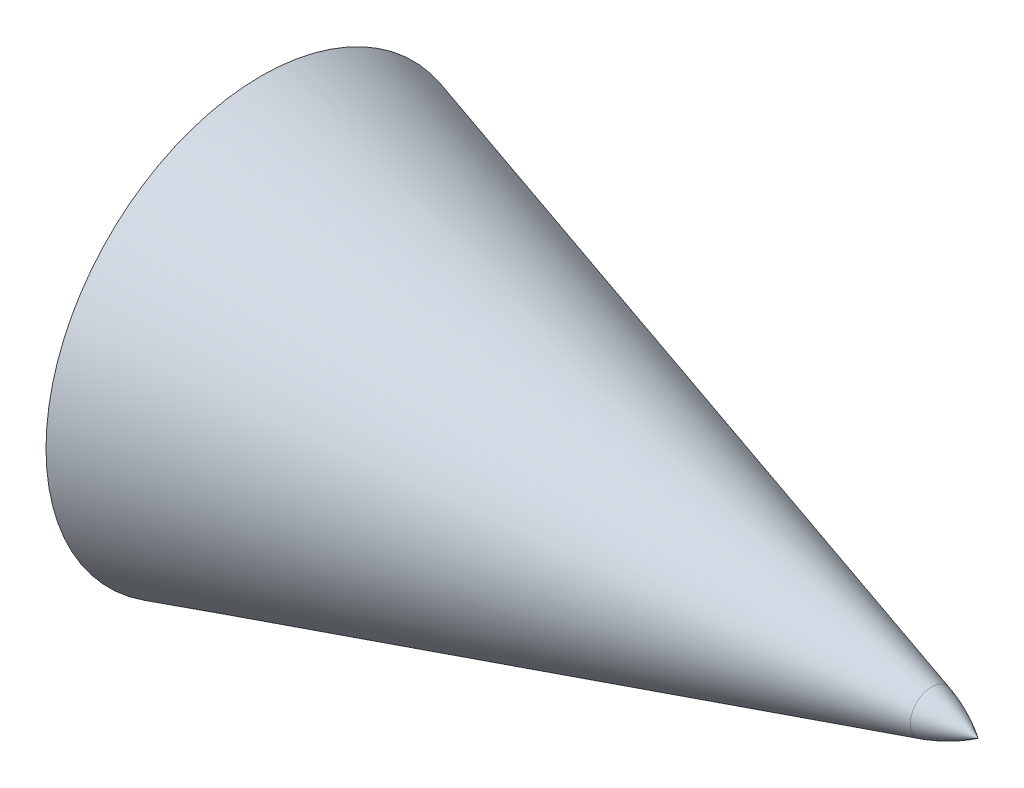
ISO-10303-21;
HEADER;
FILE_DESCRIPTION(('STEP AP214'),'2;1');
FILE_NAME('part.step','',(''),(''),'','','');
FILE_SCHEMA(('AUTOMOTIVE_DESIGN { 1 0 10303 214 1 1 1 1 }'));
ENDSEC;
DATA;
#1=APPLICATION_CONTEXT('core data for automotive mechanical design processes');
#2=APPLICATION_PROTOCOL_DEFINITION('international standard','automotive_design',2000,#1);
#3=PRODUCT_CONTEXT('',#1,'mechanical');
#4=PRODUCT('Part','Part','',(#3));
#5=PRODUCT_RELATED_PRODUCT_CATEGORY('part','',(#4));
#6=PRODUCT_DEFINITION_FORMATION('','',#4);
#7=PRODUCT_DEFINITION_CONTEXT('part definition',#1,'design');
#8=PRODUCT_DEFINITION('design','',#6,#7);
#9=PRODUCT_DEFINITION_SHAPE('','',#8);
#10=(LENGTH_UNIT() NAMED_UNIT(*) SI_UNIT(.MILLI.,.METRE.));
#11=(NAMED_UNIT(*) PLANE_ANGLE_UNIT() SI_UNIT($,.RADIAN.));
#12=(NAMED_UNIT(*) SI_UNIT($,.STERADIAN.) SOLID_ANGLE_UNIT());
#13=UNCERTAINTY_MEASURE_WITH_UNIT(LENGTH_MEASURE(1.E-05),#10,'distance_accuracy_value','');
#14=(GEOMETRIC_REPRESENTATION_CONTEXT(3) GLOBAL_UNCERTAINTY_ASSIGNED_CONTEXT((#13)) GLOBAL_UNIT_ASSIGNED_CONTEXT((#10,
#11,#12)) REPRESENTATION_CONTEXT('',''));
#15=CARTESIAN_POINT('',(0.,0.,0.));
#16=DIRECTION('',(0.,0.,1.));
#17=DIRECTION('',(1.,0.,0.));
#18=AXIS2_PLACEMENT_3D('',#15,#16,#17);
#19=CARTESIAN_POINT('',(-6.58022854623998,0.,-10.0791086122798));
#20=DIRECTION('',(0.,-1.,0.));
#21=DIRECTION('',(0.,0.,1.));
#22=AXIS2_PLACEMENT_3D('',#19,#20,#21);
#23=CIRCLE('',#22,12.0369364100208);
#24=TRIMMED_CURVE('',#23,(PARAMETER_VALUE(-0.578381865446877)),
(PARAMETER_VALUE(0.578381865446877)),.T.,.PARAMETER.);
#25=CARTESIAN_POINT('',(-6.58022854623998,0.,0.));
#26=DIRECTION('',(-1.,0.,0.));
#27=AXIS1_PLACEMENT('',#25,#26);
#28=SURFACE_OF_REVOLUTION('',#24,#27);
#29=CARTESIAN_POINT('',(-3.23802592472333,0.,0.));
#30=DIRECTION('',(-1.,0.,0.));
#31=DIRECTION('',(0.,0.,1.));
#32=AXIS2_PLACEMENT_3D('',#29,#30,#31);
#33=CIRCLE('',#32,1.48452056612314);
#34=CARTESIAN_POINT('',(-3.23802592472333,0.,1.48452056612314));
#35=VERTEX_POINT('',#34);
#36=EDGE_CURVE('E46',#35,#35,#33,.T.);
#37=ORIENTED_EDGE('',*,*,#36,.F.);
#38=EDGE_LOOP('',(#37));
#39=FACE_BOUND('',#38,.T.);
#40=CARTESIAN_POINT('',(0.,0.,0.));
#41=VERTEX_POINT('',#40);
#42=VERTEX_LOOP('',#41);
#43=FACE_BOUND('',#42,.T.);
#44=ADVANCED_FACE('F39',(#39,#43),#28,.T.);
#45=CARTESIAN_POINT('',(-50.,15.,0.));
#46=DIRECTION('',(1.,0.,0.));
#47=DIRECTION('',(0.,0.,-1.));
#48=AXIS2_PLACEMENT_3D('',#45,#46,#47);
#49=PLANE('',#48);
#50=CARTESIAN_POINT('',(-50.,0.,0.));
#51=DIRECTION('',(1.,0.,0.));
#52=DIRECTION('',(0.,0.,-1.));
#53=AXIS2_PLACEMENT_3D('',#50,#51,#52);
#54=CIRCLE('',#53,12.7);
#55=CARTESIAN_POINT('',(-50.,0.,-12.7));
#56=VERTEX_POINT('',#55);
#57=EDGE_CURVE('E64',#56,#56,#54,.T.);
#58=ORIENTED_EDGE('',*,*,#57,.T.);
#59=EDGE_LOOP('',(#58));
#60=FACE_BOUND('',#59,.T.);
#61=CARTESIAN_POINT('',(-50.,0.,0.));
#62=DIRECTION('',(-1.,0.,0.));
#63=DIRECTION('',(0.,0.,1.));
#64=AXIS2_PLACEMENT_3D('',#61,#62,#63);
#65=CIRCLE('',#64,15.);
#66=CARTESIAN_POINT('',(-50.,0.,15.));
#67=VERTEX_POINT('',#66);
#68=EDGE_CURVE('E11',#67,#67,#65,.T.);
#69=ORIENTED_EDGE('',*,*,#68,.T.);
#70=EDGE_LOOP('',(#69));
#71=FACE_BOUND('',#70,.T.);
#72=ADVANCED_FACE('F50',(#60,#71),#49,.F.);
#73=CARTESIAN_POINT('',(-3.23802592472333,0.,0.));
#74=DIRECTION('',(-1.,0.,0.));
#75=DIRECTION('',(0.,0.,1.));
#76=AXIS2_PLACEMENT_3D('',#73,#74,#75);
#77=CONICAL_SURFACE('',#76,1.48452056612314,0.2813597952568);
#78=ORIENTED_EDGE('',*,*,#68,.F.);
#79=EDGE_LOOP('',(#78));
#80=FACE_BOUND('',#79,.T.);
#81=ORIENTED_EDGE('',*,*,#36,.T.);
#82=EDGE_LOOP('',(#81));
#83=FACE_BOUND('',#82,.T.);
#84=ADVANCED_FACE('F55',(#80,#83),#77,.T.);
#85=CARTESIAN_POINT('',(-45.,0.,0.));
#86=DIRECTION('',(-1.,0.,0.));
#87=DIRECTION('',(0.,0.,1.));
#88=AXIS2_PLACEMENT_3D('',#85,#86,#87);
#89=CYLINDRICAL_SURFACE('',#88,12.7);
#90=CARTESIAN_POINT('',(-45.,0.,0.));
#91=DIRECTION('',(1.,0.,0.));
#92=DIRECTION('',(0.,0.,-1.));
#93=AXIS2_PLACEMENT_3D('',#90,#91,#92);
#94=CIRCLE('',#93,12.7);
#95=CARTESIAN_POINT('',(-45.,0.,-12.7));
#96=VERTEX_POINT('',#95);
#97=EDGE_CURVE('E61',#96,#96,#94,.T.);
#98=ORIENTED_EDGE('',*,*,#97,.T.);
#99=EDGE_LOOP('',(#98));
#100=FACE_BOUND('',#99,.T.);
#101=ORIENTED_EDGE('',*,*,#57,.F.);
#102=EDGE_LOOP('',(#101));
#103=FACE_BOUND('',#102,.T.);
#104=ADVANCED_FACE('F72',(#100,#103),#89,.F.);
#105=CARTESIAN_POINT('',(-45.,0.,0.));
#106=DIRECTION('',(1.,0.,0.));
#107=DIRECTION('',(0.,0.,-1.));
#108=AXIS2_PLACEMENT_3D('',#105,#106,#107);
#109=PLANE('',#108);
#110=ORIENTED_EDGE('',*,*,#97,.F.);
#111=EDGE_LOOP('',(#110));
#112=FACE_BOUND('',#111,.T.);
#113=ADVANCED_FACE('F74',(#112),#109,.F.);
#114=CLOSED_SHELL('',(#44,#72,#84,#104,#113));
#115=MANIFOLD_SOLID_BREP('B2',#114);
#116=ADVANCED_BREP_SHAPE_REPRESENTATION('',(#18,#115),#14);
#117=SHAPE_DEFINITION_REPRESENTATION(#9,#116);
ENDSEC;
END-ISO-10303-21;
